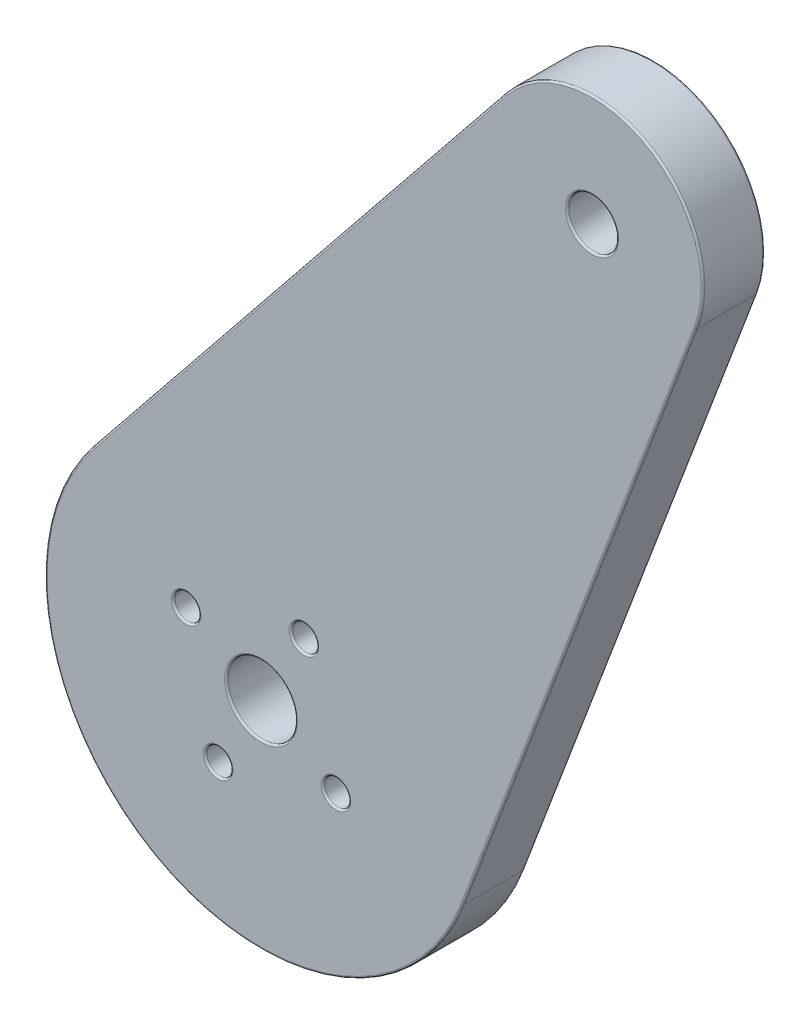
ISO-10303-21;
HEADER;
FILE_DESCRIPTION(('STEP AP214'),'2;1');
FILE_NAME('part.step','',(''),(''),'','','');
FILE_SCHEMA(('AUTOMOTIVE_DESIGN { 1 0 10303 214 1 1 1 1 }'));
ENDSEC;
DATA;
#1=APPLICATION_CONTEXT('core data for automotive mechanical design processes');
#2=APPLICATION_PROTOCOL_DEFINITION('international standard','automotive_design',2000,#1);
#3=PRODUCT_CONTEXT('',#1,'mechanical');
#4=PRODUCT('Part','Part','',(#3));
#5=PRODUCT_RELATED_PRODUCT_CATEGORY('part','',(#4));
#6=PRODUCT_DEFINITION_FORMATION('','',#4);
#7=PRODUCT_DEFINITION_CONTEXT('part definition',#1,'design');
#8=PRODUCT_DEFINITION('design','',#6,#7);
#9=PRODUCT_DEFINITION_SHAPE('','',#8);
#10=(LENGTH_UNIT() NAMED_UNIT(*) SI_UNIT(.MILLI.,.METRE.));
#11=(NAMED_UNIT(*) PLANE_ANGLE_UNIT() SI_UNIT($,.RADIAN.));
#12=(NAMED_UNIT(*) SI_UNIT($,.STERADIAN.) SOLID_ANGLE_UNIT());
#13=UNCERTAINTY_MEASURE_WITH_UNIT(LENGTH_MEASURE(1.E-05),#10,'distance_accuracy_value','');
#14=(GEOMETRIC_REPRESENTATION_CONTEXT(3) GLOBAL_UNCERTAINTY_ASSIGNED_CONTEXT((#13)) GLOBAL_UNIT_ASSIGNED_CONTEXT((#10,
#11,#12)) REPRESENTATION_CONTEXT('',''));
#15=CARTESIAN_POINT('',(0.,0.,0.));
#16=DIRECTION('',(0.,0.,1.));
#17=DIRECTION('',(1.,0.,0.));
#18=AXIS2_PLACEMENT_3D('',#15,#16,#17);
#19=CARTESIAN_POINT('',(-20.2199999999997,57.58,-5.));
#20=DIRECTION('',(0.,0.,1.));
#21=DIRECTION('',(1.,0.,0.));
#22=AXIS2_PLACEMENT_3D('',#19,#20,#21);
#23=CYLINDRICAL_SURFACE('',#22,17.4999999999997);
#24=DIRECTION('',(0.,0.,1.));
#25=VECTOR('',#24,1.);
#26=CARTESIAN_POINT('',(-33.8484945578404,68.5578930622819,-5.));
#27=LINE('',#26,#25);
#28=CARTESIAN_POINT('',(-33.8484945578404,68.5578930622819,-4.85));
#29=VERTEX_POINT('',#28);
#30=CARTESIAN_POINT('',(-33.8484945578404,68.5578930622819,-0.15));
#31=VERTEX_POINT('',#30);
#32=EDGE_CURVE('E107',#29,#31,#27,.T.);
#33=ORIENTED_EDGE('',*,*,#32,.F.);
#34=CARTESIAN_POINT('',(-20.2199999999997,57.58,-4.85));
#35=DIRECTION('',(0.,0.,-1.));
#36=DIRECTION('',(-1.,0.,0.));
#37=AXIS2_PLACEMENT_3D('',#34,#35,#36);
#38=CIRCLE('',#37,17.4999999999997);
#39=CARTESIAN_POINT('',(-3.8539343959169,51.383073613246,-4.85));
#40=VERTEX_POINT('',#39);
#41=EDGE_CURVE('E102',#29,#40,#38,.F.);
#42=ORIENTED_EDGE('',*,*,#41,.T.);
#43=DIRECTION('',(0.,0.,1.));
#44=VECTOR('',#43,1.);
#45=CARTESIAN_POINT('',(-3.8539343959169,51.383073613246,-5.));
#46=LINE('',#45,#44);
#47=CARTESIAN_POINT('',(-3.8539343959169,51.383073613246,-0.15));
#48=VERTEX_POINT('',#47);
#49=EDGE_CURVE('E104',#40,#48,#46,.T.);
#50=ORIENTED_EDGE('',*,*,#49,.T.);
#51=CARTESIAN_POINT('',(-20.2199999999997,57.58,-0.15));
#52=DIRECTION('',(0.,0.,-1.));
#53=DIRECTION('',(-1.,0.,0.));
#54=AXIS2_PLACEMENT_3D('',#51,#52,#53);
#55=CIRCLE('',#54,17.4999999999997);
#56=EDGE_CURVE('E113',#48,#31,#55,.T.);
#57=ORIENTED_EDGE('',*,*,#56,.T.);
#58=EDGE_LOOP('',(#33,#42,#50,#57));
#59=FACE_BOUND('',#58,.T.);
#60=ADVANCED_FACE('F36',(#59),#23,.T.);
#61=CARTESIAN_POINT('',(-33.8484945578404,68.5578930622819,-5.));
#62=DIRECTION('',(-0.77877111759091,0.627308174987545,0.));
#63=DIRECTION('',(-0.627308174987545,-0.77877111759091,0.));
#64=AXIS2_PLACEMENT_3D('',#61,#62,#63);
#65=PLANE('',#64);
#66=DIRECTION('',(0.,0.,1.));
#67=VECTOR('',#66,1.);
#68=CARTESIAN_POINT('',(-0.396142845402547,110.087282233173,-5.));
#69=LINE('',#68,#67);
#70=CARTESIAN_POINT('',(-0.396142845402547,110.087282233173,-4.85));
#71=VERTEX_POINT('',#70);
#72=CARTESIAN_POINT('',(-0.396142845402547,110.087282233173,-0.15));
#73=VERTEX_POINT('',#72);
#74=EDGE_CURVE('E261',#71,#73,#69,.T.);
#75=ORIENTED_EDGE('',*,*,#74,.F.);
#76=DIRECTION('',(-0.627308174987545,-0.77877111759091,0.));
#77=VECTOR('',#76,1.);
#78=CARTESIAN_POINT('',(-33.8484945578404,68.5578930622819,-4.85));
#79=LINE('',#78,#77);
#80=EDGE_CURVE('E175',#71,#29,#79,.T.);
#81=ORIENTED_EDGE('',*,*,#80,.T.);
#82=ORIENTED_EDGE('',*,*,#32,.T.);
#83=DIRECTION('',(-0.627308174987545,-0.77877111759091,0.));
#84=VECTOR('',#83,1.);
#85=CARTESIAN_POINT('',(-0.396142845402555,110.087282233173,-0.15));
#86=LINE('',#85,#84);
#87=EDGE_CURVE('E172',#31,#73,#86,.F.);
#88=ORIENTED_EDGE('',*,*,#87,.T.);
#89=EDGE_LOOP('',(#75,#81,#82,#88));
#90=FACE_BOUND('',#89,.T.);
#91=ADVANCED_FACE('F258',(#90),#65,.T.);
#92=CARTESIAN_POINT('',(6.61279721291564,104.441508658285,-5.));
#93=DIRECTION('',(0.,0.,1.));
#94=DIRECTION('',(1.,0.,0.));
#95=AXIS2_PLACEMENT_3D('',#92,#93,#94);
#96=CYLINDRICAL_SURFACE('',#95,8.99999999999999);
#97=DIRECTION('',(0.,0.,1.));
#98=VECTOR('',#97,1.);
#99=CARTESIAN_POINT('',(15.0296309521584,101.254517945098,-5.));
#100=LINE('',#99,#98);
#101=CARTESIAN_POINT('',(15.0296309521584,101.254517945098,-4.85));
#102=VERTEX_POINT('',#101);
#103=CARTESIAN_POINT('',(15.0296309521584,101.254517945098,-0.15));
#104=VERTEX_POINT('',#103);
#105=EDGE_CURVE('E124',#102,#104,#100,.T.);
#106=ORIENTED_EDGE('',*,*,#105,.F.);
#107=CARTESIAN_POINT('',(6.61279721291564,104.441508658285,-4.85));
#108=DIRECTION('',(0.,0.,-1.));
#109=DIRECTION('',(-1.,0.,0.));
#110=AXIS2_PLACEMENT_3D('',#107,#108,#109);
#111=CIRCLE('',#110,8.99999999999999);
#112=EDGE_CURVE('E170',#102,#71,#111,.F.);
#113=ORIENTED_EDGE('',*,*,#112,.T.);
#114=ORIENTED_EDGE('',*,*,#74,.T.);
#115=CARTESIAN_POINT('',(6.61279721291564,104.441508658285,-0.15));
#116=DIRECTION('',(0.,0.,-1.));
#117=DIRECTION('',(-1.,0.,0.));
#118=AXIS2_PLACEMENT_3D('',#115,#116,#117);
#119=CIRCLE('',#118,8.99999999999999);
#120=EDGE_CURVE('E168',#73,#104,#119,.T.);
#121=ORIENTED_EDGE('',*,*,#120,.T.);
#122=EDGE_LOOP('',(#106,#113,#114,#121));
#123=FACE_BOUND('',#122,.T.);
#124=ADVANCED_FACE('F309',(#123),#96,.T.);
#125=CARTESIAN_POINT('',(-3.8539343959169,51.383073613246,-5.));
#126=DIRECTION('',(0.935203748804747,-0.354110079243091,0.));
#127=DIRECTION('',(0.354110079243091,0.935203748804747,0.));
#128=AXIS2_PLACEMENT_3D('',#125,#126,#127);
#129=PLANE('',#128);
#130=ORIENTED_EDGE('',*,*,#49,.F.);
#131=DIRECTION('',(0.354110079243091,0.935203748804747,0.));
#132=VECTOR('',#131,1.);
#133=CARTESIAN_POINT('',(-3.8539343959169,51.383073613246,-4.85));
#134=LINE('',#133,#132);
#135=EDGE_CURVE('E120',#40,#102,#134,.T.);
#136=ORIENTED_EDGE('',*,*,#135,.T.);
#137=ORIENTED_EDGE('',*,*,#105,.T.);
#138=DIRECTION('',(0.354110079243091,0.935203748804747,0.));
#139=VECTOR('',#138,1.);
#140=CARTESIAN_POINT('',(-3.8539343959169,51.383073613246,-0.15));
#141=LINE('',#140,#139);
#142=EDGE_CURVE('E123',#104,#48,#141,.F.);
#143=ORIENTED_EDGE('',*,*,#142,.T.);
#144=EDGE_LOOP('',(#130,#136,#137,#143));
#145=FACE_BOUND('',#144,.T.);
#146=ADVANCED_FACE('F117',(#145),#129,.T.);
#147=CARTESIAN_POINT('',(-20.2199999999997,57.58,-5.));
#148=DIRECTION('',(0.,0.,-1.));
#149=DIRECTION('',(-1.,0.,0.));
#150=AXIS2_PLACEMENT_3D('',#147,#148,#149);
#151=PLANE('',#150);
#152=CARTESIAN_POINT('',(6.61279721291564,104.441508658285,-5.));
#153=DIRECTION('',(0.,0.,-1.));
#154=DIRECTION('',(-1.,0.,0.));
#155=AXIS2_PLACEMENT_3D('',#152,#153,#154);
#156=CIRCLE('',#155,8.84999999999999);
#157=CARTESIAN_POINT('',(-0.27932717776391,109.993186006925,-5.));
#158=VERTEX_POINT('',#157);
#159=CARTESIAN_POINT('',(14.8893503898376,101.307634456984,-5.));
#160=VERTEX_POINT('',#159);
#161=EDGE_CURVE('E164',#158,#160,#156,.T.);
#162=ORIENTED_EDGE('',*,*,#161,.T.);
#163=DIRECTION('',(0.354110079243091,0.935203748804747,0.));
#164=VECTOR('',#163,1.);
#165=CARTESIAN_POINT('',(-3.99421495823761,51.4361901251325,-5.));
#166=LINE('',#165,#164);
#167=CARTESIAN_POINT('',(-3.99421495823761,51.4361901251325,-5.));
#168=VERTEX_POINT('',#167);
#169=EDGE_CURVE('E166',#160,#168,#166,.F.);
#170=ORIENTED_EDGE('',*,*,#169,.T.);
#171=CARTESIAN_POINT('',(-20.2199999999997,57.58,-5.));
#172=DIRECTION('',(0.,0.,-1.));
#173=DIRECTION('',(-1.,0.,0.));
#174=AXIS2_PLACEMENT_3D('',#171,#172,#173);
#175=CIRCLE('',#174,17.3499999999997);
#176=CARTESIAN_POINT('',(-33.7316788902018,68.4637968360337,-5.));
#177=VERTEX_POINT('',#176);
#178=EDGE_CURVE('E130',#168,#177,#175,.T.);
#179=ORIENTED_EDGE('',*,*,#178,.T.);
#180=DIRECTION('',(-0.627308174987545,-0.77877111759091,0.));
#181=VECTOR('',#180,1.);
#182=CARTESIAN_POINT('',(-33.7316788902018,68.4637968360337,-5.));
#183=LINE('',#182,#181);
#184=EDGE_CURVE('E162',#177,#158,#183,.F.);
#185=ORIENTED_EDGE('',*,*,#184,.T.);
#186=EDGE_LOOP('',(#162,#170,#179,#185));
#187=FACE_BOUND('',#186,.T.);
#188=CARTESIAN_POINT('',(-20.2199999999997,57.58,-5.));
#189=DIRECTION('',(0.,0.,-1.));
#190=DIRECTION('',(-1.,0.,0.));
#191=AXIS2_PLACEMENT_3D('',#188,#189,#190);
#192=CIRCLE('',#191,2.95);
#193=CARTESIAN_POINT('',(-23.1699999999997,57.58,-5.));
#194=VERTEX_POINT('',#193);
#195=EDGE_CURVE('E158',#194,#194,#192,.F.);
#196=ORIENTED_EDGE('',*,*,#195,.T.);
#197=EDGE_LOOP('',(#196));
#198=FACE_BOUND('',#197,.T.);
#199=CARTESIAN_POINT('',(6.61279721291564,104.441508658285,-5.));
#200=DIRECTION('',(0.,0.,-1.));
#201=DIRECTION('',(-1.,0.,0.));
#202=AXIS2_PLACEMENT_3D('',#199,#200,#201);
#203=CIRCLE('',#202,2.15);
#204=CARTESIAN_POINT('',(4.46279721291564,104.441508658285,-5.));
#205=VERTEX_POINT('',#204);
#206=EDGE_CURVE('E155',#205,#205,#203,.F.);
#207=ORIENTED_EDGE('',*,*,#206,.T.);
#208=EDGE_LOOP('',(#207));
#209=FACE_BOUND('',#208,.T.);
#210=CARTESIAN_POINT('',(-26.2946400112589,61.0583255646372,-5.));
#211=DIRECTION('',(0.,0.,-1.));
#212=DIRECTION('',(-1.,0.,0.));
#213=AXIS2_PLACEMENT_3D('',#210,#211,#212);
#214=CIRCLE('',#213,1.2);
#215=CARTESIAN_POINT('',(-27.4946400112589,61.0583255646372,-5.));
#216=VERTEX_POINT('',#215);
#217=EDGE_CURVE('E152',#216,#216,#214,.F.);
#218=ORIENTED_EDGE('',*,*,#217,.T.);
#219=EDGE_LOOP('',(#218));
#220=FACE_BOUND('',#219,.T.);
#221=CARTESIAN_POINT('',(-16.7416744353625,63.6546400112592,-5.));
#222=DIRECTION('',(0.,0.,-1.));
#223=DIRECTION('',(-1.,0.,0.));
#224=AXIS2_PLACEMENT_3D('',#221,#222,#223);
#225=CIRCLE('',#224,1.2);
#226=CARTESIAN_POINT('',(-17.9416744353625,63.6546400112592,-5.));
#227=VERTEX_POINT('',#226);
#228=EDGE_CURVE('E149',#227,#227,#225,.F.);
#229=ORIENTED_EDGE('',*,*,#228,.T.);
#230=EDGE_LOOP('',(#229));
#231=FACE_BOUND('',#230,.T.);
#232=CARTESIAN_POINT('',(-23.6983255646369,51.5053599887408,-5.));
#233=DIRECTION('',(0.,0.,-1.));
#234=DIRECTION('',(-1.,0.,0.));
#235=AXIS2_PLACEMENT_3D('',#232,#233,#234);
#236=CIRCLE('',#235,1.2);
#237=CARTESIAN_POINT('',(-24.8983255646369,51.5053599887408,-5.));
#238=VERTEX_POINT('',#237);
#239=EDGE_CURVE('E143',#238,#238,#236,.F.);
#240=ORIENTED_EDGE('',*,*,#239,.T.);
#241=EDGE_LOOP('',(#240));
#242=FACE_BOUND('',#241,.T.);
#243=CARTESIAN_POINT('',(-14.1453599887405,54.1016744353628,-5.));
#244=DIRECTION('',(0.,0.,-1.));
#245=DIRECTION('',(-1.,0.,0.));
#246=AXIS2_PLACEMENT_3D('',#243,#244,#245);
#247=CIRCLE('',#246,1.2);
#248=CARTESIAN_POINT('',(-15.3453599887405,54.1016744353628,-5.));
#249=VERTEX_POINT('',#248);
#250=EDGE_CURVE('E140',#249,#249,#247,.F.);
#251=ORIENTED_EDGE('',*,*,#250,.T.);
#252=EDGE_LOOP('',(#251));
#253=FACE_BOUND('',#252,.T.);
#254=ADVANCED_FACE('F270',(#187,#198,#209,#220,#231,#242,#253),#151,.T.);
#255=CARTESIAN_POINT('',(-20.2199999999997,57.58,0.));
#256=DIRECTION('',(0.,0.,-1.));
#257=DIRECTION('',(-1.,0.,0.));
#258=AXIS2_PLACEMENT_3D('',#255,#256,#257);
#259=PLANE('',#258);
#260=CARTESIAN_POINT('',(6.61279721291564,104.441508658285,0.));
#261=DIRECTION('',(0.,0.,-1.));
#262=DIRECTION('',(-1.,0.,0.));
#263=AXIS2_PLACEMENT_3D('',#260,#261,#262);
#264=CIRCLE('',#263,8.84999999999999);
#265=CARTESIAN_POINT('',(14.8893503898376,101.307634456984,0.));
#266=VERTEX_POINT('',#265);
#267=CARTESIAN_POINT('',(-0.27932717776391,109.993186006925,0.));
#268=VERTEX_POINT('',#267);
#269=EDGE_CURVE('E45',#266,#268,#264,.F.);
#270=ORIENTED_EDGE('',*,*,#269,.T.);
#271=DIRECTION('',(-0.627308174987545,-0.77877111759091,0.));
#272=VECTOR('',#271,1.);
#273=CARTESIAN_POINT('',(-33.7316788902018,68.4637968360337,0.));
#274=LINE('',#273,#272);
#275=CARTESIAN_POINT('',(-33.7316788902018,68.4637968360337,0.));
#276=VERTEX_POINT('',#275);
#277=EDGE_CURVE('E11',#268,#276,#274,.T.);
#278=ORIENTED_EDGE('',*,*,#277,.T.);
#279=CARTESIAN_POINT('',(-20.2199999999997,57.58,0.));
#280=DIRECTION('',(0.,0.,-1.));
#281=DIRECTION('',(-1.,0.,0.));
#282=AXIS2_PLACEMENT_3D('',#279,#280,#281);
#283=CIRCLE('',#282,17.3499999999997);
#284=CARTESIAN_POINT('',(-3.99421495823761,51.4361901251325,0.));
#285=VERTEX_POINT('',#284);
#286=EDGE_CURVE('E231',#276,#285,#283,.F.);
#287=ORIENTED_EDGE('',*,*,#286,.T.);
#288=DIRECTION('',(0.354110079243091,0.935203748804747,0.));
#289=VECTOR('',#288,1.);
#290=CARTESIAN_POINT('',(14.8893503898376,101.307634456984,0.));
#291=LINE('',#290,#289);
#292=EDGE_CURVE('E56',#285,#266,#291,.T.);
#293=ORIENTED_EDGE('',*,*,#292,.T.);
#294=EDGE_LOOP('',(#270,#278,#287,#293));
#295=FACE_BOUND('',#294,.T.);
#296=CARTESIAN_POINT('',(-20.2199999999997,57.58,0.));
#297=DIRECTION('',(0.,0.,-1.));
#298=DIRECTION('',(-1.,0.,0.));
#299=AXIS2_PLACEMENT_3D('',#296,#297,#298);
#300=CIRCLE('',#299,2.95);
#301=CARTESIAN_POINT('',(-23.1699999999997,57.58,0.));
#302=VERTEX_POINT('',#301);
#303=EDGE_CURVE('E228',#302,#302,#300,.T.);
#304=ORIENTED_EDGE('',*,*,#303,.T.);
#305=EDGE_LOOP('',(#304));
#306=FACE_BOUND('',#305,.T.);
#307=CARTESIAN_POINT('',(6.61279721291564,104.441508658285,0.));
#308=DIRECTION('',(0.,0.,-1.));
#309=DIRECTION('',(-1.,0.,0.));
#310=AXIS2_PLACEMENT_3D('',#307,#308,#309);
#311=CIRCLE('',#310,2.15);
#312=CARTESIAN_POINT('',(4.46279721291564,104.441508658285,0.));
#313=VERTEX_POINT('',#312);
#314=EDGE_CURVE('E225',#313,#313,#311,.T.);
#315=ORIENTED_EDGE('',*,*,#314,.T.);
#316=EDGE_LOOP('',(#315));
#317=FACE_BOUND('',#316,.T.);
#318=CARTESIAN_POINT('',(-26.2946400112589,61.0583255646372,0.));
#319=DIRECTION('',(0.,0.,-1.));
#320=DIRECTION('',(-1.,0.,0.));
#321=AXIS2_PLACEMENT_3D('',#318,#319,#320);
#322=CIRCLE('',#321,1.2);
#323=CARTESIAN_POINT('',(-27.4946400112589,61.0583255646372,0.));
#324=VERTEX_POINT('',#323);
#325=EDGE_CURVE('E222',#324,#324,#322,.T.);
#326=ORIENTED_EDGE('',*,*,#325,.T.);
#327=EDGE_LOOP('',(#326));
#328=FACE_BOUND('',#327,.T.);
#329=CARTESIAN_POINT('',(-16.7416744353625,63.6546400112592,0.));
#330=DIRECTION('',(0.,0.,-1.));
#331=DIRECTION('',(-1.,0.,0.));
#332=AXIS2_PLACEMENT_3D('',#329,#330,#331);
#333=CIRCLE('',#332,1.2);
#334=CARTESIAN_POINT('',(-17.9416744353625,63.6546400112592,0.));
#335=VERTEX_POINT('',#334);
#336=EDGE_CURVE('E219',#335,#335,#333,.T.);
#337=ORIENTED_EDGE('',*,*,#336,.T.);
#338=EDGE_LOOP('',(#337));
#339=FACE_BOUND('',#338,.T.);
#340=CARTESIAN_POINT('',(-23.6983255646369,51.5053599887408,0.));
#341=DIRECTION('',(0.,0.,-1.));
#342=DIRECTION('',(-1.,0.,0.));
#343=AXIS2_PLACEMENT_3D('',#340,#341,#342);
#344=CIRCLE('',#343,1.2);
#345=CARTESIAN_POINT('',(-24.8983255646369,51.5053599887408,0.));
#346=VERTEX_POINT('',#345);
#347=EDGE_CURVE('E216',#346,#346,#344,.T.);
#348=ORIENTED_EDGE('',*,*,#347,.T.);
#349=EDGE_LOOP('',(#348));
#350=FACE_BOUND('',#349,.T.);
#351=CARTESIAN_POINT('',(-14.1453599887405,54.1016744353628,0.));
#352=DIRECTION('',(0.,0.,-1.));
#353=DIRECTION('',(-1.,0.,0.));
#354=AXIS2_PLACEMENT_3D('',#351,#352,#353);
#355=CIRCLE('',#354,1.2);
#356=CARTESIAN_POINT('',(-15.3453599887405,54.1016744353628,0.));
#357=VERTEX_POINT('',#356);
#358=EDGE_CURVE('E213',#357,#357,#355,.T.);
#359=ORIENTED_EDGE('',*,*,#358,.T.);
#360=EDGE_LOOP('',(#359));
#361=FACE_BOUND('',#360,.T.);
#362=ADVANCED_FACE('F266',(#295,#306,#317,#328,#339,#350,#361),#259,.F.);
#363=CARTESIAN_POINT('',(-20.2199999999997,57.58,-5.));
#364=DIRECTION('',(0.,0.,1.));
#365=DIRECTION('',(1.,0.,0.));
#366=AXIS2_PLACEMENT_3D('',#363,#364,#365);
#367=CYLINDRICAL_SURFACE('',#366,2.8);
#368=CARTESIAN_POINT('',(-20.2199999999997,57.58,-4.85));
#369=DIRECTION('',(0.,0.,-1.));
#370=DIRECTION('',(-1.,0.,0.));
#371=AXIS2_PLACEMENT_3D('',#368,#369,#370);
#372=CIRCLE('',#371,2.8);
#373=CARTESIAN_POINT('',(-23.0199999999997,57.58,-4.85));
#374=VERTEX_POINT('',#373);
#375=EDGE_CURVE('E180',#374,#374,#372,.T.);
#376=ORIENTED_EDGE('',*,*,#375,.T.);
#377=EDGE_LOOP('',(#376));
#378=FACE_BOUND('',#377,.T.);
#379=CARTESIAN_POINT('',(-20.2199999999997,57.58,-0.15));
#380=DIRECTION('',(0.,0.,-1.));
#381=DIRECTION('',(-1.,0.,0.));
#382=AXIS2_PLACEMENT_3D('',#379,#380,#381);
#383=CIRCLE('',#382,2.8);
#384=CARTESIAN_POINT('',(-23.0199999999997,57.58,-0.15));
#385=VERTEX_POINT('',#384);
#386=EDGE_CURVE('E112',#385,#385,#383,.F.);
#387=ORIENTED_EDGE('',*,*,#386,.T.);
#388=EDGE_LOOP('',(#387));
#389=FACE_BOUND('',#388,.T.);
#390=ADVANCED_FACE('F269',(#378,#389),#367,.F.);
#391=CARTESIAN_POINT('',(6.61279721291564,104.441508658285,-5.));
#392=DIRECTION('',(0.,0.,1.));
#393=DIRECTION('',(1.,0.,0.));
#394=AXIS2_PLACEMENT_3D('',#391,#392,#393);
#395=CYLINDRICAL_SURFACE('',#394,2.);
#396=CARTESIAN_POINT('',(6.61279721291564,104.441508658285,-4.85));
#397=DIRECTION('',(0.,0.,-1.));
#398=DIRECTION('',(-1.,0.,0.));
#399=AXIS2_PLACEMENT_3D('',#396,#397,#398);
#400=CIRCLE('',#399,2.);
#401=CARTESIAN_POINT('',(4.61279721291564,104.441508658285,-4.85));
#402=VERTEX_POINT('',#401);
#403=EDGE_CURVE('E186',#402,#402,#400,.T.);
#404=ORIENTED_EDGE('',*,*,#403,.T.);
#405=EDGE_LOOP('',(#404));
#406=FACE_BOUND('',#405,.T.);
#407=CARTESIAN_POINT('',(6.61279721291564,104.441508658285,-0.15));
#408=DIRECTION('',(0.,0.,-1.));
#409=DIRECTION('',(-1.,0.,0.));
#410=AXIS2_PLACEMENT_3D('',#407,#408,#409);
#411=CIRCLE('',#410,2.);
#412=CARTESIAN_POINT('',(4.61279721291564,104.441508658285,-0.15));
#413=VERTEX_POINT('',#412);
#414=EDGE_CURVE('E183',#413,#413,#411,.F.);
#415=ORIENTED_EDGE('',*,*,#414,.T.);
#416=EDGE_LOOP('',(#415));
#417=FACE_BOUND('',#416,.T.);
#418=ADVANCED_FACE('F501',(#406,#417),#395,.F.);
#419=CARTESIAN_POINT('',(-26.2946400112589,61.0583255646372,-5.));
#420=DIRECTION('',(0.,0.,1.));
#421=DIRECTION('',(1.,0.,0.));
#422=AXIS2_PLACEMENT_3D('',#419,#420,#421);
#423=CYLINDRICAL_SURFACE('',#422,1.05);
#424=CARTESIAN_POINT('',(-26.2946400112589,61.0583255646372,-4.85));
#425=DIRECTION('',(0.,0.,-1.));
#426=DIRECTION('',(-1.,0.,0.));
#427=AXIS2_PLACEMENT_3D('',#424,#425,#426);
#428=CIRCLE('',#427,1.05);
#429=CARTESIAN_POINT('',(-27.3446400112589,61.0583255646372,-4.85));
#430=VERTEX_POINT('',#429);
#431=EDGE_CURVE('E192',#430,#430,#428,.T.);
#432=ORIENTED_EDGE('',*,*,#431,.T.);
#433=EDGE_LOOP('',(#432));
#434=FACE_BOUND('',#433,.T.);
#435=CARTESIAN_POINT('',(-26.2946400112589,61.0583255646372,-0.15));
#436=DIRECTION('',(0.,0.,-1.));
#437=DIRECTION('',(-1.,0.,0.));
#438=AXIS2_PLACEMENT_3D('',#435,#436,#437);
#439=CIRCLE('',#438,1.05);
#440=CARTESIAN_POINT('',(-27.3446400112589,61.0583255646372,-0.15));
#441=VERTEX_POINT('',#440);
#442=EDGE_CURVE('E189',#441,#441,#439,.F.);
#443=ORIENTED_EDGE('',*,*,#442,.T.);
#444=EDGE_LOOP('',(#443));
#445=FACE_BOUND('',#444,.T.);
#446=ADVANCED_FACE('F492',(#434,#445),#423,.F.);
#447=CARTESIAN_POINT('',(-16.7416744353625,63.6546400112592,-5.));
#448=DIRECTION('',(0.,0.,1.));
#449=DIRECTION('',(1.,0.,0.));
#450=AXIS2_PLACEMENT_3D('',#447,#448,#449);
#451=CYLINDRICAL_SURFACE('',#450,1.05);
#452=CARTESIAN_POINT('',(-16.7416744353625,63.6546400112592,-4.85));
#453=DIRECTION('',(0.,0.,-1.));
#454=DIRECTION('',(-1.,0.,0.));
#455=AXIS2_PLACEMENT_3D('',#452,#453,#454);
#456=CIRCLE('',#455,1.05);
#457=CARTESIAN_POINT('',(-17.7916744353625,63.6546400112592,-4.85));
#458=VERTEX_POINT('',#457);
#459=EDGE_CURVE('E198',#458,#458,#456,.T.);
#460=ORIENTED_EDGE('',*,*,#459,.T.);
#461=EDGE_LOOP('',(#460));
#462=FACE_BOUND('',#461,.T.);
#463=CARTESIAN_POINT('',(-16.7416744353625,63.6546400112592,-0.15));
#464=DIRECTION('',(0.,0.,-1.));
#465=DIRECTION('',(-1.,0.,0.));
#466=AXIS2_PLACEMENT_3D('',#463,#464,#465);
#467=CIRCLE('',#466,1.05);
#468=CARTESIAN_POINT('',(-17.7916744353625,63.6546400112592,-0.15));
#469=VERTEX_POINT('',#468);
#470=EDGE_CURVE('E195',#469,#469,#467,.F.);
#471=ORIENTED_EDGE('',*,*,#470,.T.);
#472=EDGE_LOOP('',(#471));
#473=FACE_BOUND('',#472,.T.);
#474=ADVANCED_FACE('F301',(#462,#473),#451,.F.);
#475=CARTESIAN_POINT('',(-23.6983255646369,51.5053599887408,-5.));
#476=DIRECTION('',(0.,0.,1.));
#477=DIRECTION('',(1.,0.,0.));
#478=AXIS2_PLACEMENT_3D('',#475,#476,#477);
#479=CYLINDRICAL_SURFACE('',#478,1.05);
#480=CARTESIAN_POINT('',(-23.6983255646369,51.5053599887408,-4.85));
#481=DIRECTION('',(0.,0.,-1.));
#482=DIRECTION('',(-1.,0.,0.));
#483=AXIS2_PLACEMENT_3D('',#480,#481,#482);
#484=CIRCLE('',#483,1.05);
#485=CARTESIAN_POINT('',(-24.7483255646369,51.5053599887408,-4.85));
#486=VERTEX_POINT('',#485);
#487=EDGE_CURVE('E204',#486,#486,#484,.T.);
#488=ORIENTED_EDGE('',*,*,#487,.T.);
#489=EDGE_LOOP('',(#488));
#490=FACE_BOUND('',#489,.T.);
#491=CARTESIAN_POINT('',(-23.6983255646369,51.5053599887408,-0.15));
#492=DIRECTION('',(0.,0.,-1.));
#493=DIRECTION('',(-1.,0.,0.));
#494=AXIS2_PLACEMENT_3D('',#491,#492,#493);
#495=CIRCLE('',#494,1.05);
#496=CARTESIAN_POINT('',(-24.7483255646369,51.5053599887408,-0.15));
#497=VERTEX_POINT('',#496);
#498=EDGE_CURVE('E201',#497,#497,#495,.F.);
#499=ORIENTED_EDGE('',*,*,#498,.T.);
#500=EDGE_LOOP('',(#499));
#501=FACE_BOUND('',#500,.T.);
#502=ADVANCED_FACE('F292',(#490,#501),#479,.F.);
#503=CARTESIAN_POINT('',(-14.1453599887405,54.1016744353628,-5.));
#504=DIRECTION('',(0.,0.,1.));
#505=DIRECTION('',(1.,0.,0.));
#506=AXIS2_PLACEMENT_3D('',#503,#504,#505);
#507=CYLINDRICAL_SURFACE('',#506,1.05);
#508=CARTESIAN_POINT('',(-14.1453599887405,54.1016744353628,-4.85));
#509=DIRECTION('',(0.,0.,-1.));
#510=DIRECTION('',(-1.,0.,0.));
#511=AXIS2_PLACEMENT_3D('',#508,#509,#510);
#512=CIRCLE('',#511,1.05);
#513=CARTESIAN_POINT('',(-15.1953599887405,54.1016744353628,-4.85));
#514=VERTEX_POINT('',#513);
#515=EDGE_CURVE('E210',#514,#514,#512,.T.);
#516=ORIENTED_EDGE('',*,*,#515,.T.);
#517=EDGE_LOOP('',(#516));
#518=FACE_BOUND('',#517,.T.);
#519=CARTESIAN_POINT('',(-14.1453599887405,54.1016744353628,-0.15));
#520=DIRECTION('',(0.,0.,-1.));
#521=DIRECTION('',(-1.,0.,0.));
#522=AXIS2_PLACEMENT_3D('',#519,#520,#521);
#523=CIRCLE('',#522,1.05);
#524=CARTESIAN_POINT('',(-15.1953599887405,54.1016744353628,-0.15));
#525=VERTEX_POINT('',#524);
#526=EDGE_CURVE('E207',#525,#525,#523,.F.);
#527=ORIENTED_EDGE('',*,*,#526,.T.);
#528=EDGE_LOOP('',(#527));
#529=FACE_BOUND('',#528,.T.);
#530=ADVANCED_FACE('F289',(#518,#529),#507,.F.);
#531=CARTESIAN_POINT('',(-33.7316788902018,68.4637968360337,-4.85));
#532=DIRECTION('',(-0.627308174987545,-0.77877111759091,0.));
#533=DIRECTION('',(0.77877111759091,-0.627308174987545,0.));
#534=AXIS2_PLACEMENT_3D('',#531,#532,#533);
#535=CYLINDRICAL_SURFACE('',#534,0.15);
#536=CARTESIAN_POINT('',(-0.27932717776391,109.993186006925,-4.85));
#537=DIRECTION('',(0.627308174987551,0.778771117590905,0.));
#538=DIRECTION('',(-0.778771117590906,0.627308174987551,0.));
#539=AXIS2_PLACEMENT_3D('',#536,#537,#538);
#540=CIRCLE('',#539,0.15);
#541=EDGE_CURVE('E134',#158,#71,#540,.T.);
#542=ORIENTED_EDGE('',*,*,#541,.F.);
#543=ORIENTED_EDGE('',*,*,#184,.F.);
#544=CARTESIAN_POINT('',(-33.7316788902018,68.4637968360337,-4.85));
#545=DIRECTION('',(-0.627308174987546,-0.77877111759091,0.));
#546=DIRECTION('',(0.77877111759091,-0.627308174987546,0.));
#547=AXIS2_PLACEMENT_3D('',#544,#545,#546);
#548=CIRCLE('',#547,0.15);
#549=EDGE_CURVE('E125',#29,#177,#548,.T.);
#550=ORIENTED_EDGE('',*,*,#549,.F.);
#551=ORIENTED_EDGE('',*,*,#80,.F.);
#552=EDGE_LOOP('',(#542,#543,#550,#551));
#553=FACE_BOUND('',#552,.T.);
#554=ADVANCED_FACE('F291',(#553),#535,.T.);
#555=CARTESIAN_POINT('',(-20.2199999999997,57.58,-4.85));
#556=DIRECTION('',(0.,0.,-1.));
#557=DIRECTION('',(-1.,0.,0.));
#558=AXIS2_PLACEMENT_3D('',#555,#556,#557);
#559=TOROIDAL_SURFACE('',#558,17.3499999999997,0.15);
#560=ORIENTED_EDGE('',*,*,#549,.T.);
#561=ORIENTED_EDGE('',*,*,#178,.F.);
#562=CARTESIAN_POINT('',(-3.99421495823761,51.4361901251325,-4.85));
#563=DIRECTION('',(0.354110079243086,0.935203748804749,0.));
#564=DIRECTION('',(-0.935203748804749,0.354110079243086,0.));
#565=AXIS2_PLACEMENT_3D('',#562,#563,#564);
#566=CIRCLE('',#565,0.15);
#567=EDGE_CURVE('E128',#40,#168,#566,.T.);
#568=ORIENTED_EDGE('',*,*,#567,.F.);
#569=ORIENTED_EDGE('',*,*,#41,.F.);
#570=EDGE_LOOP('',(#560,#561,#568,#569));
#571=FACE_BOUND('',#570,.T.);
#572=ADVANCED_FACE('F129',(#571),#559,.T.);
#573=CARTESIAN_POINT('',(6.61279721291564,104.441508658285,-4.85));
#574=DIRECTION('',(0.,0.,-1.));
#575=DIRECTION('',(-1.,0.,0.));
#576=AXIS2_PLACEMENT_3D('',#573,#574,#575);
#577=TOROIDAL_SURFACE('',#576,8.84999999999999,0.15);
#578=ORIENTED_EDGE('',*,*,#541,.T.);
#579=ORIENTED_EDGE('',*,*,#112,.F.);
#580=CARTESIAN_POINT('',(14.8893503898376,101.307634456984,-4.85));
#581=DIRECTION('',(-0.354110079243125,-0.935203748804734,0.));
#582=DIRECTION('',(0.935203748804734,-0.354110079243125,0.));
#583=AXIS2_PLACEMENT_3D('',#580,#581,#582);
#584=CIRCLE('',#583,0.15);
#585=EDGE_CURVE('E135',#160,#102,#584,.T.);
#586=ORIENTED_EDGE('',*,*,#585,.F.);
#587=ORIENTED_EDGE('',*,*,#161,.F.);
#588=EDGE_LOOP('',(#578,#579,#586,#587));
#589=FACE_BOUND('',#588,.T.);
#590=ADVANCED_FACE('F317',(#589),#577,.T.);
#591=CARTESIAN_POINT('',(-3.99421495823762,51.4361901251325,-4.85));
#592=DIRECTION('',(0.354110079243091,0.935203748804747,0.));
#593=DIRECTION('',(-0.935203748804747,0.354110079243091,0.));
#594=AXIS2_PLACEMENT_3D('',#591,#592,#593);
#595=CYLINDRICAL_SURFACE('',#594,0.15);
#596=ORIENTED_EDGE('',*,*,#567,.T.);
#597=ORIENTED_EDGE('',*,*,#169,.F.);
#598=ORIENTED_EDGE('',*,*,#585,.T.);
#599=ORIENTED_EDGE('',*,*,#135,.F.);
#600=EDGE_LOOP('',(#596,#597,#598,#599));
#601=FACE_BOUND('',#600,.T.);
#602=ADVANCED_FACE('F137',(#601),#595,.T.);
#603=CARTESIAN_POINT('',(-20.2199999999997,57.58,-4.85));
#604=DIRECTION('',(0.,0.,-1.));
#605=DIRECTION('',(-1.,0.,0.));
#606=AXIS2_PLACEMENT_3D('',#603,#604,#605);
#607=TOROIDAL_SURFACE('',#606,2.95,0.15);
#608=ORIENTED_EDGE('',*,*,#375,.F.);
#609=EDGE_LOOP('',(#608));
#610=FACE_BOUND('',#609,.T.);
#611=ORIENTED_EDGE('',*,*,#195,.F.);
#612=EDGE_LOOP('',(#611));
#613=FACE_BOUND('',#612,.T.);
#614=ADVANCED_FACE('F316',(#610,#613),#607,.T.);
#615=CARTESIAN_POINT('',(6.61279721291564,104.441508658285,-4.85));
#616=DIRECTION('',(0.,0.,-1.));
#617=DIRECTION('',(-1.,0.,0.));
#618=AXIS2_PLACEMENT_3D('',#615,#616,#617);
#619=TOROIDAL_SURFACE('',#618,2.15,0.15);
#620=ORIENTED_EDGE('',*,*,#403,.F.);
#621=EDGE_LOOP('',(#620));
#622=FACE_BOUND('',#621,.T.);
#623=ORIENTED_EDGE('',*,*,#206,.F.);
#624=EDGE_LOOP('',(#623));
#625=FACE_BOUND('',#624,.T.);
#626=ADVANCED_FACE('F325',(#622,#625),#619,.T.);
#627=CARTESIAN_POINT('',(-26.2946400112589,61.0583255646372,-4.85));
#628=DIRECTION('',(0.,0.,-1.));
#629=DIRECTION('',(-1.,0.,0.));
#630=AXIS2_PLACEMENT_3D('',#627,#628,#629);
#631=TOROIDAL_SURFACE('',#630,1.2,0.15);
#632=ORIENTED_EDGE('',*,*,#431,.F.);
#633=EDGE_LOOP('',(#632));
#634=FACE_BOUND('',#633,.T.);
#635=ORIENTED_EDGE('',*,*,#217,.F.);
#636=EDGE_LOOP('',(#635));
#637=FACE_BOUND('',#636,.T.);
#638=ADVANCED_FACE('F329',(#634,#637),#631,.T.);
#639=CARTESIAN_POINT('',(-16.7416744353625,63.6546400112592,-4.85));
#640=DIRECTION('',(0.,0.,-1.));
#641=DIRECTION('',(-1.,0.,0.));
#642=AXIS2_PLACEMENT_3D('',#639,#640,#641);
#643=TOROIDAL_SURFACE('',#642,1.2,0.15);
#644=ORIENTED_EDGE('',*,*,#459,.F.);
#645=EDGE_LOOP('',(#644));
#646=FACE_BOUND('',#645,.T.);
#647=ORIENTED_EDGE('',*,*,#228,.F.);
#648=EDGE_LOOP('',(#647));
#649=FACE_BOUND('',#648,.T.);
#650=ADVANCED_FACE('F333',(#646,#649),#643,.T.);
#651=CARTESIAN_POINT('',(-23.6983255646369,51.5053599887408,-4.85));
#652=DIRECTION('',(0.,0.,-1.));
#653=DIRECTION('',(-1.,0.,0.));
#654=AXIS2_PLACEMENT_3D('',#651,#652,#653);
#655=TOROIDAL_SURFACE('',#654,1.2,0.15);
#656=ORIENTED_EDGE('',*,*,#487,.F.);
#657=EDGE_LOOP('',(#656));
#658=FACE_BOUND('',#657,.T.);
#659=ORIENTED_EDGE('',*,*,#239,.F.);
#660=EDGE_LOOP('',(#659));
#661=FACE_BOUND('',#660,.T.);
#662=ADVANCED_FACE('F337',(#658,#661),#655,.T.);
#663=CARTESIAN_POINT('',(-14.1453599887405,54.1016744353628,-4.85));
#664=DIRECTION('',(0.,0.,-1.));
#665=DIRECTION('',(-1.,0.,0.));
#666=AXIS2_PLACEMENT_3D('',#663,#664,#665);
#667=TOROIDAL_SURFACE('',#666,1.2,0.15);
#668=ORIENTED_EDGE('',*,*,#515,.F.);
#669=EDGE_LOOP('',(#668));
#670=FACE_BOUND('',#669,.T.);
#671=ORIENTED_EDGE('',*,*,#250,.F.);
#672=EDGE_LOOP('',(#671));
#673=FACE_BOUND('',#672,.T.);
#674=ADVANCED_FACE('F341',(#670,#673),#667,.T.);
#675=CARTESIAN_POINT('',(-3.99421495823761,51.4361901251325,-0.15));
#676=DIRECTION('',(-0.354110079243091,-0.935203748804747,0.));
#677=DIRECTION('',(0.935203748804747,-0.354110079243091,0.));
#678=AXIS2_PLACEMENT_3D('',#675,#676,#677);
#679=CYLINDRICAL_SURFACE('',#678,0.15);
#680=CARTESIAN_POINT('',(-3.99421495823762,51.4361901251325,-0.15));
#681=DIRECTION('',(-0.354110079243085,-0.935203748804749,0.));
#682=DIRECTION('',(0.935203748804749,-0.354110079243085,0.));
#683=AXIS2_PLACEMENT_3D('',#680,#681,#682);
#684=CIRCLE('',#683,0.15);
#685=EDGE_CURVE('E242',#48,#285,#684,.T.);
#686=ORIENTED_EDGE('',*,*,#685,.F.);
#687=ORIENTED_EDGE('',*,*,#142,.F.);
#688=CARTESIAN_POINT('',(14.8893503898376,101.307634456984,-0.15));
#689=DIRECTION('',(0.354110079243129,0.935203748804732,0.));
#690=DIRECTION('',(-0.935203748804732,0.354110079243129,0.));
#691=AXIS2_PLACEMENT_3D('',#688,#689,#690);
#692=CIRCLE('',#691,0.15);
#693=EDGE_CURVE('E40',#266,#104,#692,.T.);
#694=ORIENTED_EDGE('',*,*,#693,.F.);
#695=ORIENTED_EDGE('',*,*,#292,.F.);
#696=EDGE_LOOP('',(#686,#687,#694,#695));
#697=FACE_BOUND('',#696,.T.);
#698=ADVANCED_FACE('F252',(#697),#679,.T.);
#699=CARTESIAN_POINT('',(6.61279721291564,104.441508658285,-0.15));
#700=DIRECTION('',(0.,0.,-1.));
#701=DIRECTION('',(-1.,0.,0.));
#702=AXIS2_PLACEMENT_3D('',#699,#700,#701);
#703=TOROIDAL_SURFACE('',#702,8.84999999999999,0.15);
#704=ORIENTED_EDGE('',*,*,#693,.T.);
#705=ORIENTED_EDGE('',*,*,#120,.F.);
#706=CARTESIAN_POINT('',(-0.27932717776391,109.993186006925,-0.15));
#707=DIRECTION('',(-0.627308174987551,-0.778771117590906,0.));
#708=DIRECTION('',(0.778771117590906,-0.627308174987551,0.));
#709=AXIS2_PLACEMENT_3D('',#706,#707,#708);
#710=CIRCLE('',#709,0.15);
#711=EDGE_CURVE('E241',#268,#73,#710,.T.);
#712=ORIENTED_EDGE('',*,*,#711,.F.);
#713=ORIENTED_EDGE('',*,*,#269,.F.);
#714=EDGE_LOOP('',(#704,#705,#712,#713));
#715=FACE_BOUND('',#714,.T.);
#716=ADVANCED_FACE('F250',(#715),#703,.T.);
#717=CARTESIAN_POINT('',(-20.2199999999997,57.58,-0.15));
#718=DIRECTION('',(0.,0.,-1.));
#719=DIRECTION('',(-1.,0.,0.));
#720=AXIS2_PLACEMENT_3D('',#717,#718,#719);
#721=TOROIDAL_SURFACE('',#720,17.3499999999997,0.15);
#722=ORIENTED_EDGE('',*,*,#685,.T.);
#723=ORIENTED_EDGE('',*,*,#286,.F.);
#724=CARTESIAN_POINT('',(-33.7316788902018,68.4637968360337,-0.15));
#725=DIRECTION('',(0.627308174987546,0.77877111759091,0.));
#726=DIRECTION('',(-0.77877111759091,0.627308174987546,0.));
#727=AXIS2_PLACEMENT_3D('',#724,#725,#726);
#728=CIRCLE('',#727,0.15);
#729=EDGE_CURVE('E239',#31,#276,#728,.T.);
#730=ORIENTED_EDGE('',*,*,#729,.F.);
#731=ORIENTED_EDGE('',*,*,#56,.F.);
#732=EDGE_LOOP('',(#722,#723,#730,#731));
#733=FACE_BOUND('',#732,.T.);
#734=ADVANCED_FACE('F254',(#733),#721,.T.);
#735=CARTESIAN_POINT('',(-33.7316788902018,68.4637968360338,-0.15));
#736=DIRECTION('',(0.627308174987545,0.77877111759091,0.));
#737=DIRECTION('',(-0.77877111759091,0.627308174987545,0.));
#738=AXIS2_PLACEMENT_3D('',#735,#736,#737);
#739=CYLINDRICAL_SURFACE('',#738,0.15);
#740=ORIENTED_EDGE('',*,*,#711,.T.);
#741=ORIENTED_EDGE('',*,*,#87,.F.);
#742=ORIENTED_EDGE('',*,*,#729,.T.);
#743=ORIENTED_EDGE('',*,*,#277,.F.);
#744=EDGE_LOOP('',(#740,#741,#742,#743));
#745=FACE_BOUND('',#744,.T.);
#746=ADVANCED_FACE('F264',(#745),#739,.T.);
#747=CARTESIAN_POINT('',(-20.2199999999997,57.58,-0.15));
#748=DIRECTION('',(0.,0.,-1.));
#749=DIRECTION('',(-1.,0.,0.));
#750=AXIS2_PLACEMENT_3D('',#747,#748,#749);
#751=TOROIDAL_SURFACE('',#750,2.95,0.15);
#752=ORIENTED_EDGE('',*,*,#303,.F.);
#753=EDGE_LOOP('',(#752));
#754=FACE_BOUND('',#753,.T.);
#755=ORIENTED_EDGE('',*,*,#386,.F.);
#756=EDGE_LOOP('',(#755));
#757=FACE_BOUND('',#756,.T.);
#758=ADVANCED_FACE('F348',(#754,#757),#751,.T.);
#759=CARTESIAN_POINT('',(6.61279721291564,104.441508658285,-0.15));
#760=DIRECTION('',(0.,0.,-1.));
#761=DIRECTION('',(-1.,0.,0.));
#762=AXIS2_PLACEMENT_3D('',#759,#760,#761);
#763=TOROIDAL_SURFACE('',#762,2.15,0.15);
#764=ORIENTED_EDGE('',*,*,#314,.F.);
#765=EDGE_LOOP('',(#764));
#766=FACE_BOUND('',#765,.T.);
#767=ORIENTED_EDGE('',*,*,#414,.F.);
#768=EDGE_LOOP('',(#767));
#769=FACE_BOUND('',#768,.T.);
#770=ADVANCED_FACE('F357',(#766,#769),#763,.T.);
#771=CARTESIAN_POINT('',(-26.2946400112589,61.0583255646372,-0.15));
#772=DIRECTION('',(0.,0.,-1.));
#773=DIRECTION('',(-1.,0.,0.));
#774=AXIS2_PLACEMENT_3D('',#771,#772,#773);
#775=TOROIDAL_SURFACE('',#774,1.2,0.15);
#776=ORIENTED_EDGE('',*,*,#325,.F.);
#777=EDGE_LOOP('',(#776));
#778=FACE_BOUND('',#777,.T.);
#779=ORIENTED_EDGE('',*,*,#442,.F.);
#780=EDGE_LOOP('',(#779));
#781=FACE_BOUND('',#780,.T.);
#782=ADVANCED_FACE('F361',(#778,#781),#775,.T.);
#783=CARTESIAN_POINT('',(-16.7416744353625,63.6546400112592,-0.15));
#784=DIRECTION('',(0.,0.,-1.));
#785=DIRECTION('',(-1.,0.,0.));
#786=AXIS2_PLACEMENT_3D('',#783,#784,#785);
#787=TOROIDAL_SURFACE('',#786,1.2,0.15);
#788=ORIENTED_EDGE('',*,*,#336,.F.);
#789=EDGE_LOOP('',(#788));
#790=FACE_BOUND('',#789,.T.);
#791=ORIENTED_EDGE('',*,*,#470,.F.);
#792=EDGE_LOOP('',(#791));
#793=FACE_BOUND('',#792,.T.);
#794=ADVANCED_FACE('F365',(#790,#793),#787,.T.);
#795=CARTESIAN_POINT('',(-23.6983255646369,51.5053599887408,-0.15));
#796=DIRECTION('',(0.,0.,-1.));
#797=DIRECTION('',(-1.,0.,0.));
#798=AXIS2_PLACEMENT_3D('',#795,#796,#797);
#799=TOROIDAL_SURFACE('',#798,1.2,0.15);
#800=ORIENTED_EDGE('',*,*,#347,.F.);
#801=EDGE_LOOP('',(#800));
#802=FACE_BOUND('',#801,.T.);
#803=ORIENTED_EDGE('',*,*,#498,.F.);
#804=EDGE_LOOP('',(#803));
#805=FACE_BOUND('',#804,.T.);
#806=ADVANCED_FACE('F286',(#802,#805),#799,.T.);
#807=CARTESIAN_POINT('',(-14.1453599887405,54.1016744353628,-0.15));
#808=DIRECTION('',(0.,0.,-1.));
#809=DIRECTION('',(-1.,0.,0.));
#810=AXIS2_PLACEMENT_3D('',#807,#808,#809);
#811=TOROIDAL_SURFACE('',#810,1.2,0.15);
#812=ORIENTED_EDGE('',*,*,#358,.F.);
#813=EDGE_LOOP('',(#812));
#814=FACE_BOUND('',#813,.T.);
#815=ORIENTED_EDGE('',*,*,#526,.F.);
#816=EDGE_LOOP('',(#815));
#817=FACE_BOUND('',#816,.T.);
#818=ADVANCED_FACE('F38',(#814,#817),#811,.T.);
#819=CLOSED_SHELL('',(#60,#91,#124,#146,#254,#362,#390,#418,#446,#474,#502,#530,#554,#572,#590,
#602,#614,#626,#638,#650,#662,#674,#698,#716,#734,#746,#758,#770,#782,#794,#806,#818));
#820=MANIFOLD_SOLID_BREP('B2',#819);
#821=ADVANCED_BREP_SHAPE_REPRESENTATION('',(#18,#820),#14);
#822=SHAPE_DEFINITION_REPRESENTATION(#9,#821);
ENDSEC;
END-ISO-10303-21;
